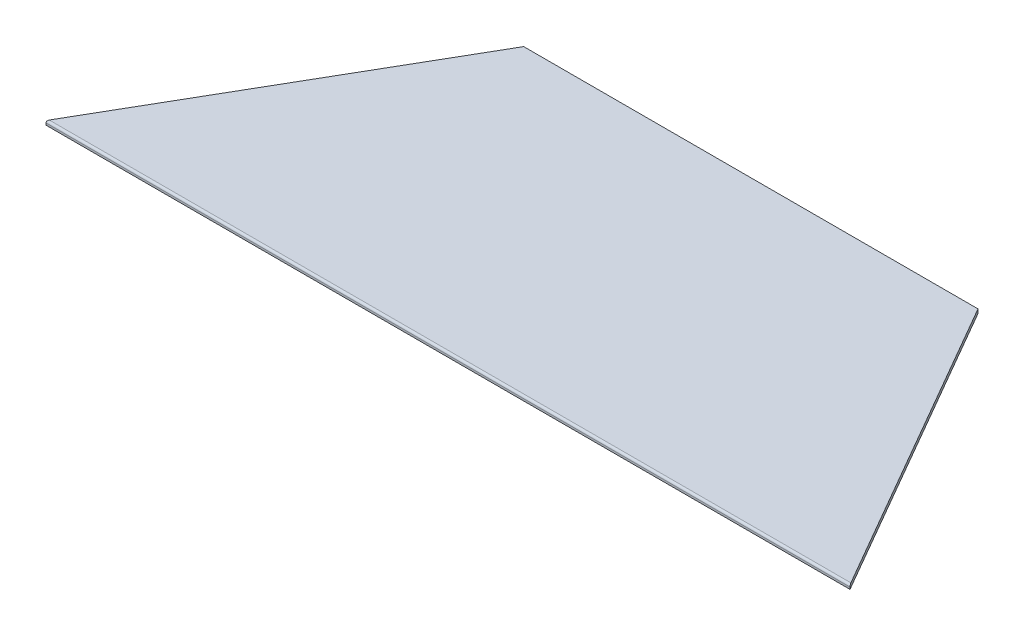
ISO-10303-21;
HEADER;
FILE_DESCRIPTION(('STEP AP214'),'2;1');
FILE_NAME('part.step','',(''),(''),'','','');
FILE_SCHEMA(('AUTOMOTIVE_DESIGN { 1 0 10303 214 1 1 1 1 }'));
ENDSEC;
DATA;
#1=APPLICATION_CONTEXT('core data for automotive mechanical design processes');
#2=APPLICATION_PROTOCOL_DEFINITION('international standard','automotive_design',2000,#1);
#3=PRODUCT_CONTEXT('',#1,'mechanical');
#4=PRODUCT('Part','Part','',(#3));
#5=PRODUCT_RELATED_PRODUCT_CATEGORY('part','',(#4));
#6=PRODUCT_DEFINITION_FORMATION('','',#4);
#7=PRODUCT_DEFINITION_CONTEXT('part definition',#1,'design');
#8=PRODUCT_DEFINITION('design','',#6,#7);
#9=PRODUCT_DEFINITION_SHAPE('','',#8);
#10=(LENGTH_UNIT() NAMED_UNIT(*) SI_UNIT(.MILLI.,.METRE.));
#11=(NAMED_UNIT(*) PLANE_ANGLE_UNIT() SI_UNIT($,.RADIAN.));
#12=(NAMED_UNIT(*) SI_UNIT($,.STERADIAN.) SOLID_ANGLE_UNIT());
#13=UNCERTAINTY_MEASURE_WITH_UNIT(LENGTH_MEASURE(1.E-05),#10,'distance_accuracy_value','');
#14=(GEOMETRIC_REPRESENTATION_CONTEXT(3) GLOBAL_UNCERTAINTY_ASSIGNED_CONTEXT((#13)) GLOBAL_UNIT_ASSIGNED_CONTEXT((#10,
#11,#12)) REPRESENTATION_CONTEXT('',''));
#15=CARTESIAN_POINT('',(0.,0.,0.));
#16=DIRECTION('',(0.,0.,1.));
#17=DIRECTION('',(1.,0.,0.));
#18=AXIS2_PLACEMENT_3D('',#15,#16,#17);
#19=CARTESIAN_POINT('',(87.9881810244999,2.0574,-152.4));
#20=DIRECTION('',(0.866025403784436,0.,0.500000000000004));
#21=DIRECTION('',(0.500000000000004,0.,-0.866025403784436));
#22=AXIS2_PLACEMENT_3D('',#19,#20,#21);
#23=PLANE('',#22);
#24=DIRECTION('',(0.,-1.,0.));
#25=VECTOR('',#24,1.);
#26=CARTESIAN_POINT('',(0.,2.0574,0.));
#27=LINE('',#26,#25);
#28=CARTESIAN_POINT('',(0.,1.0287,0.));
#29=VERTEX_POINT('',#28);
#30=CARTESIAN_POINT('',(0.,0.,0.));
#31=VERTEX_POINT('',#30);
#32=EDGE_CURVE('E115',#29,#31,#27,.T.);
#33=ORIENTED_EDGE('',*,*,#32,.F.);
#34=CARTESIAN_POINT('',(0.593920221915366,1.0287,-1.0287));
#35=DIRECTION('',(0.866025403784436,0.,0.500000000000004));
#36=DIRECTION('',(-0.500000000000004,0.,0.866025403784436));
#37=AXIS2_PLACEMENT_3D('',#34,#35,#36);
#38=ELLIPSE('',#37,1.18784044383074,1.0287);
#39=CARTESIAN_POINT('',(0.593920221915359,2.0574,-1.02869999999997));
#40=VERTEX_POINT('',#39);
#41=EDGE_CURVE('E11',#29,#40,#38,.F.);
#42=ORIENTED_EDGE('',*,*,#41,.T.);
#43=DIRECTION('',(-0.500000000000004,0.,0.866025403784436));
#44=VECTOR('',#43,1.);
#45=CARTESIAN_POINT('',(87.9881810244999,2.0574,-152.4));
#46=LINE('',#45,#44);
#47=CARTESIAN_POINT('',(87.9881810244999,2.0574,-152.4));
#48=VERTEX_POINT('',#47);
#49=EDGE_CURVE('E86',#48,#40,#46,.T.);
#50=ORIENTED_EDGE('',*,*,#49,.F.);
#51=DIRECTION('',(0.,-1.,0.));
#52=VECTOR('',#51,1.);
#53=CARTESIAN_POINT('',(87.9881810244999,2.0574,-152.4));
#54=LINE('',#53,#52);
#55=CARTESIAN_POINT('',(87.9881810244999,0.,-152.4));
#56=VERTEX_POINT('',#55);
#57=EDGE_CURVE('E96',#48,#56,#54,.T.);
#58=ORIENTED_EDGE('',*,*,#57,.T.);
#59=DIRECTION('',(-0.500000000000004,0.,0.866025403784436));
#60=VECTOR('',#59,1.);
#61=CARTESIAN_POINT('',(87.9881810244999,0.,-152.4));
#62=LINE('',#61,#60);
#63=EDGE_CURVE('E105',#56,#31,#62,.T.);
#64=ORIENTED_EDGE('',*,*,#63,.T.);
#65=EDGE_LOOP('',(#33,#42,#50,#58,#64));
#66=FACE_BOUND('',#65,.T.);
#67=ADVANCED_FACE('F33',(#66),#23,.F.);
#68=CARTESIAN_POINT('',(0.,2.0574,0.));
#69=DIRECTION('',(0.,0.,-1.));
#70=DIRECTION('',(-1.,0.,0.));
#71=AXIS2_PLACEMENT_3D('',#68,#69,#70);
#72=PLANE('',#71);
#73=DIRECTION('',(0.,-1.,0.));
#74=VECTOR('',#73,1.);
#75=CARTESIAN_POINT('',(404.576362048998,2.0574,0.));
#76=LINE('',#75,#74);
#77=CARTESIAN_POINT('',(404.576362048998,1.0287,0.));
#78=VERTEX_POINT('',#77);
#79=CARTESIAN_POINT('',(404.576362048998,0.,0.));
#80=VERTEX_POINT('',#79);
#81=EDGE_CURVE('E95',#78,#80,#76,.T.);
#82=ORIENTED_EDGE('',*,*,#81,.F.);
#83=DIRECTION('',(1.,0.,0.));
#84=VECTOR('',#83,1.);
#85=CARTESIAN_POINT('',(0.,1.0287,0.));
#86=LINE('',#85,#84);
#87=EDGE_CURVE('E41',#78,#29,#86,.F.);
#88=ORIENTED_EDGE('',*,*,#87,.T.);
#89=ORIENTED_EDGE('',*,*,#32,.T.);
#90=DIRECTION('',(1.,0.,0.));
#91=VECTOR('',#90,1.);
#92=CARTESIAN_POINT('',(0.,0.,0.));
#93=LINE('',#92,#91);
#94=EDGE_CURVE('E108',#31,#80,#93,.T.);
#95=ORIENTED_EDGE('',*,*,#94,.T.);
#96=EDGE_LOOP('',(#82,#88,#89,#95));
#97=FACE_BOUND('',#96,.T.);
#98=ADVANCED_FACE('F119',(#97),#72,.F.);
#99=CARTESIAN_POINT('',(316.5881810245,2.0574,-152.4));
#100=DIRECTION('',(-0.86602540378444,0.,0.499999999999998));
#101=DIRECTION('',(0.499999999999998,0.,0.86602540378444));
#102=AXIS2_PLACEMENT_3D('',#99,#100,#101);
#103=PLANE('',#102);
#104=DIRECTION('',(-0.499999999999998,0.,-0.86602540378444));
#105=VECTOR('',#104,1.);
#106=CARTESIAN_POINT('',(316.5881810245,2.0574,-152.4));
#107=LINE('',#106,#105);
#108=CARTESIAN_POINT('',(403.982441827083,2.0574,-1.02869999999999));
#109=VERTEX_POINT('',#108);
#110=CARTESIAN_POINT('',(316.5881810245,2.0574,-152.4));
#111=VERTEX_POINT('',#110);
#112=EDGE_CURVE('E77',#109,#111,#107,.T.);
#113=ORIENTED_EDGE('',*,*,#112,.F.);
#114=CARTESIAN_POINT('',(403.982441827083,1.0287,-1.0287));
#115=DIRECTION('',(-0.86602540378444,0.,0.499999999999998));
#116=DIRECTION('',(-0.499999999999998,0.,-0.86602540378444));
#117=AXIS2_PLACEMENT_3D('',#114,#115,#116);
#118=ELLIPSE('',#117,1.18784044383073,1.0287);
#119=EDGE_CURVE('E55',#109,#78,#118,.F.);
#120=ORIENTED_EDGE('',*,*,#119,.T.);
#121=ORIENTED_EDGE('',*,*,#81,.T.);
#122=DIRECTION('',(-0.499999999999998,0.,-0.86602540378444));
#123=VECTOR('',#122,1.);
#124=CARTESIAN_POINT('',(316.5881810245,0.,-152.4));
#125=LINE('',#124,#123);
#126=CARTESIAN_POINT('',(316.5881810245,0.,-152.4));
#127=VERTEX_POINT('',#126);
#128=EDGE_CURVE('E92',#80,#127,#125,.T.);
#129=ORIENTED_EDGE('',*,*,#128,.T.);
#130=DIRECTION('',(0.,-1.,0.));
#131=VECTOR('',#130,1.);
#132=CARTESIAN_POINT('',(316.5881810245,2.0574,-152.4));
#133=LINE('',#132,#131);
#134=EDGE_CURVE('E89',#111,#127,#133,.T.);
#135=ORIENTED_EDGE('',*,*,#134,.F.);
#136=EDGE_LOOP('',(#113,#120,#121,#129,#135));
#137=FACE_BOUND('',#136,.T.);
#138=ADVANCED_FACE('F90',(#137),#103,.F.);
#139=CARTESIAN_POINT('',(87.9881810244999,2.0574,-152.4));
#140=DIRECTION('',(0.,0.,1.));
#141=DIRECTION('',(1.,0.,0.));
#142=AXIS2_PLACEMENT_3D('',#139,#140,#141);
#143=PLANE('',#142);
#144=DIRECTION('',(-1.,0.,0.));
#145=VECTOR('',#144,1.);
#146=CARTESIAN_POINT('',(87.9881810244999,0.,-152.4));
#147=LINE('',#146,#145);
#148=EDGE_CURVE('E112',#127,#56,#147,.T.);
#149=ORIENTED_EDGE('',*,*,#148,.T.);
#150=ORIENTED_EDGE('',*,*,#57,.F.);
#151=DIRECTION('',(-1.,0.,0.));
#152=VECTOR('',#151,1.);
#153=CARTESIAN_POINT('',(87.9881810244999,2.0574,-152.4));
#154=LINE('',#153,#152);
#155=EDGE_CURVE('E82',#111,#48,#154,.T.);
#156=ORIENTED_EDGE('',*,*,#155,.F.);
#157=ORIENTED_EDGE('',*,*,#134,.T.);
#158=EDGE_LOOP('',(#149,#150,#156,#157));
#159=FACE_BOUND('',#158,.T.);
#160=ADVANCED_FACE('F98',(#159),#143,.F.);
#161=CARTESIAN_POINT('',(0.,2.0574,0.));
#162=DIRECTION('',(0.,1.,0.));
#163=DIRECTION('',(0.,0.,1.));
#164=AXIS2_PLACEMENT_3D('',#161,#162,#163);
#165=PLANE('',#164);
#166=ORIENTED_EDGE('',*,*,#49,.T.);
#167=DIRECTION('',(1.,0.,0.));
#168=VECTOR('',#167,1.);
#169=CARTESIAN_POINT('',(404.576362048998,2.0574,-1.0287));
#170=LINE('',#169,#168);
#171=EDGE_CURVE('E85',#40,#109,#170,.T.);
#172=ORIENTED_EDGE('',*,*,#171,.T.);
#173=ORIENTED_EDGE('',*,*,#112,.T.);
#174=ORIENTED_EDGE('',*,*,#155,.T.);
#175=EDGE_LOOP('',(#166,#172,#173,#174));
#176=FACE_BOUND('',#175,.T.);
#177=ADVANCED_FACE('F80',(#176),#165,.T.);
#178=CARTESIAN_POINT('',(0.,0.,0.));
#179=DIRECTION('',(0.,1.,0.));
#180=DIRECTION('',(0.,0.,1.));
#181=AXIS2_PLACEMENT_3D('',#178,#179,#180);
#182=PLANE('',#181);
#183=ORIENTED_EDGE('',*,*,#63,.F.);
#184=ORIENTED_EDGE('',*,*,#148,.F.);
#185=ORIENTED_EDGE('',*,*,#128,.F.);
#186=ORIENTED_EDGE('',*,*,#94,.F.);
#187=EDGE_LOOP('',(#183,#184,#185,#186));
#188=FACE_BOUND('',#187,.T.);
#189=ADVANCED_FACE('F124',(#188),#182,.F.);
#190=CARTESIAN_POINT('',(0.,1.0287,-1.0287));
#191=DIRECTION('',(-1.,0.,0.));
#192=DIRECTION('',(0.,0.,1.));
#193=AXIS2_PLACEMENT_3D('',#190,#191,#192);
#194=CYLINDRICAL_SURFACE('',#193,1.0287);
#195=ORIENTED_EDGE('',*,*,#41,.F.);
#196=ORIENTED_EDGE('',*,*,#87,.F.);
#197=ORIENTED_EDGE('',*,*,#119,.F.);
#198=ORIENTED_EDGE('',*,*,#171,.F.);
#199=EDGE_LOOP('',(#195,#196,#197,#198));
#200=FACE_BOUND('',#199,.T.);
#201=ADVANCED_FACE('F35',(#200),#194,.T.);
#202=CLOSED_SHELL('',(#67,#98,#138,#160,#177,#189,#201));
#203=MANIFOLD_SOLID_BREP('B2',#202);
#204=ADVANCED_BREP_SHAPE_REPRESENTATION('',(#18,#203),#14);
#205=SHAPE_DEFINITION_REPRESENTATION(#9,#204);
ENDSEC;
END-ISO-10303-21;
